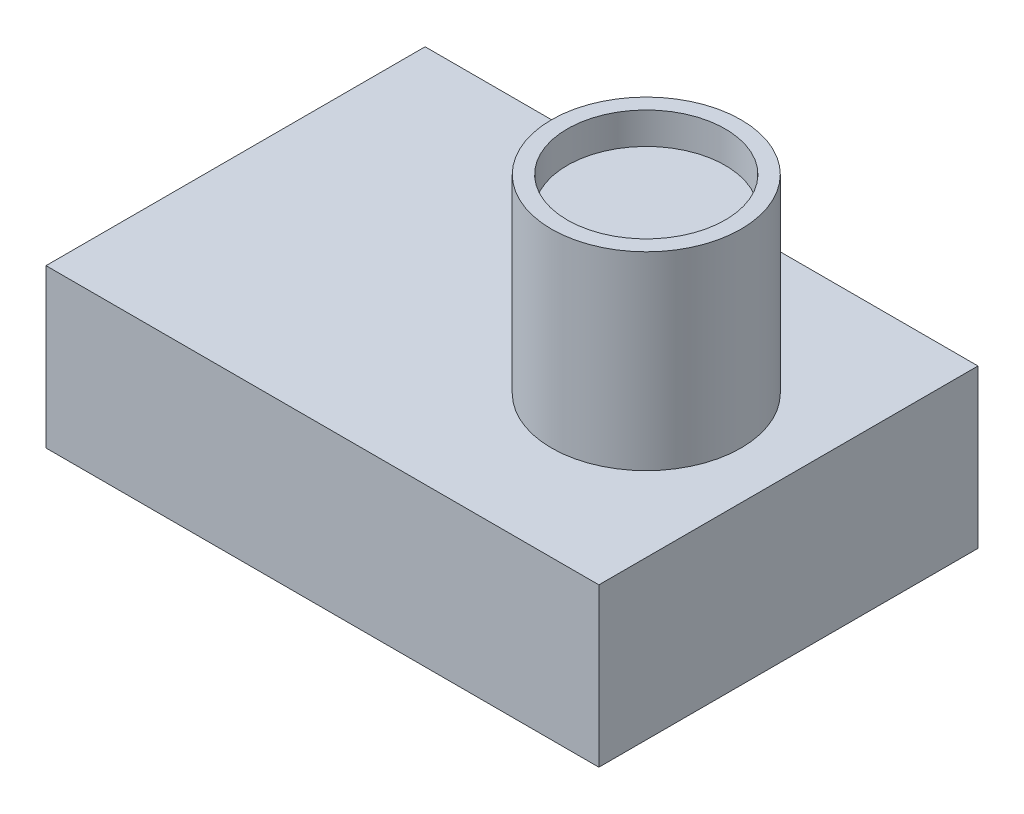
ISO-10303-21;
HEADER;
FILE_DESCRIPTION(('STEP AP214'),'2;1');
FILE_NAME('part.step','',(''),(''),'','','');
FILE_SCHEMA(('AUTOMOTIVE_DESIGN { 1 0 10303 214 1 1 1 1 }'));
ENDSEC;
DATA;
#1=APPLICATION_CONTEXT('core data for automotive mechanical design processes');
#2=APPLICATION_PROTOCOL_DEFINITION('international standard','automotive_design',2000,#1);
#3=PRODUCT_CONTEXT('',#1,'mechanical');
#4=PRODUCT('Part','Part','',(#3));
#5=PRODUCT_RELATED_PRODUCT_CATEGORY('part','',(#4));
#6=PRODUCT_DEFINITION_FORMATION('','',#4);
#7=PRODUCT_DEFINITION_CONTEXT('part definition',#1,'design');
#8=PRODUCT_DEFINITION('design','',#6,#7);
#9=PRODUCT_DEFINITION_SHAPE('','',#8);
#10=(LENGTH_UNIT() NAMED_UNIT(*) SI_UNIT(.MILLI.,.METRE.));
#11=(NAMED_UNIT(*) PLANE_ANGLE_UNIT() SI_UNIT($,.RADIAN.));
#12=(NAMED_UNIT(*) SI_UNIT($,.STERADIAN.) SOLID_ANGLE_UNIT());
#13=UNCERTAINTY_MEASURE_WITH_UNIT(LENGTH_MEASURE(1.E-05),#10,'distance_accuracy_value','');
#14=(GEOMETRIC_REPRESENTATION_CONTEXT(3) GLOBAL_UNCERTAINTY_ASSIGNED_CONTEXT((#13)) GLOBAL_UNIT_ASSIGNED_CONTEXT((#10,
#11,#12)) REPRESENTATION_CONTEXT('',''));
#15=CARTESIAN_POINT('',(0.,0.,0.));
#16=DIRECTION('',(0.,0.,1.));
#17=DIRECTION('',(1.,0.,0.));
#18=AXIS2_PLACEMENT_3D('',#15,#16,#17);
#19=CARTESIAN_POINT('',(17.5,10.,-12.));
#20=DIRECTION('',(-1.,0.,0.));
#21=DIRECTION('',(0.,0.,1.));
#22=AXIS2_PLACEMENT_3D('',#19,#20,#21);
#23=PLANE('',#22);
#24=DIRECTION('',(0.,0.,-1.));
#25=VECTOR('',#24,1.);
#26=CARTESIAN_POINT('',(17.5,0.,-12.));
#27=LINE('',#26,#25);
#28=CARTESIAN_POINT('',(17.5,0.,12.));
#29=VERTEX_POINT('',#28);
#30=CARTESIAN_POINT('',(17.5,0.,-12.));
#31=VERTEX_POINT('',#30);
#32=EDGE_CURVE('E105',#29,#31,#27,.T.);
#33=ORIENTED_EDGE('',*,*,#32,.T.);
#34=DIRECTION('',(0.,-1.,0.));
#35=VECTOR('',#34,1.);
#36=CARTESIAN_POINT('',(17.5,10.,-12.));
#37=LINE('',#36,#35);
#38=CARTESIAN_POINT('',(17.5,10.,-12.));
#39=VERTEX_POINT('',#38);
#40=EDGE_CURVE('E11',#39,#31,#37,.T.);
#41=ORIENTED_EDGE('',*,*,#40,.F.);
#42=DIRECTION('',(0.,0.,-1.));
#43=VECTOR('',#42,1.);
#44=CARTESIAN_POINT('',(17.5,10.,-12.));
#45=LINE('',#44,#43);
#46=CARTESIAN_POINT('',(17.5,10.,12.));
#47=VERTEX_POINT('',#46);
#48=EDGE_CURVE('E93',#47,#39,#45,.T.);
#49=ORIENTED_EDGE('',*,*,#48,.F.);
#50=DIRECTION('',(0.,-1.,0.));
#51=VECTOR('',#50,1.);
#52=CARTESIAN_POINT('',(17.5,10.,12.));
#53=LINE('',#52,#51);
#54=EDGE_CURVE('E101',#47,#29,#53,.T.);
#55=ORIENTED_EDGE('',*,*,#54,.T.);
#56=EDGE_LOOP('',(#33,#41,#49,#55));
#57=FACE_BOUND('',#56,.T.);
#58=ADVANCED_FACE('F42',(#57),#23,.F.);
#59=CARTESIAN_POINT('',(-17.5,10.,-12.));
#60=DIRECTION('',(0.,0.,1.));
#61=DIRECTION('',(1.,0.,0.));
#62=AXIS2_PLACEMENT_3D('',#59,#60,#61);
#63=PLANE('',#62);
#64=DIRECTION('',(-1.,0.,0.));
#65=VECTOR('',#64,1.);
#66=CARTESIAN_POINT('',(-17.5,0.,-12.));
#67=LINE('',#66,#65);
#68=CARTESIAN_POINT('',(-17.5,0.,-12.));
#69=VERTEX_POINT('',#68);
#70=EDGE_CURVE('E97',#31,#69,#67,.T.);
#71=ORIENTED_EDGE('',*,*,#70,.T.);
#72=DIRECTION('',(0.,-1.,0.));
#73=VECTOR('',#72,1.);
#74=CARTESIAN_POINT('',(-17.5,10.,-12.));
#75=LINE('',#74,#73);
#76=CARTESIAN_POINT('',(-17.5,10.,-12.));
#77=VERTEX_POINT('',#76);
#78=EDGE_CURVE('E50',#77,#69,#75,.T.);
#79=ORIENTED_EDGE('',*,*,#78,.F.);
#80=DIRECTION('',(-1.,0.,0.));
#81=VECTOR('',#80,1.);
#82=CARTESIAN_POINT('',(-17.5,10.,-12.));
#83=LINE('',#82,#81);
#84=EDGE_CURVE('E88',#39,#77,#83,.T.);
#85=ORIENTED_EDGE('',*,*,#84,.F.);
#86=ORIENTED_EDGE('',*,*,#40,.T.);
#87=EDGE_LOOP('',(#71,#79,#85,#86));
#88=FACE_BOUND('',#87,.T.);
#89=ADVANCED_FACE('F96',(#88),#63,.F.);
#90=CARTESIAN_POINT('',(-17.5,10.,-12.));
#91=DIRECTION('',(1.,0.,0.));
#92=DIRECTION('',(0.,0.,-1.));
#93=AXIS2_PLACEMENT_3D('',#90,#91,#92);
#94=PLANE('',#93);
#95=DIRECTION('',(0.,0.,1.));
#96=VECTOR('',#95,1.);
#97=CARTESIAN_POINT('',(-17.5,0.,-12.));
#98=LINE('',#97,#96);
#99=CARTESIAN_POINT('',(-17.5,0.,12.));
#100=VERTEX_POINT('',#99);
#101=EDGE_CURVE('E75',#69,#100,#98,.T.);
#102=ORIENTED_EDGE('',*,*,#101,.T.);
#103=DIRECTION('',(0.,-1.,0.));
#104=VECTOR('',#103,1.);
#105=CARTESIAN_POINT('',(-17.5,10.,12.));
#106=LINE('',#105,#104);
#107=CARTESIAN_POINT('',(-17.5,10.,12.));
#108=VERTEX_POINT('',#107);
#109=EDGE_CURVE('E98',#108,#100,#106,.T.);
#110=ORIENTED_EDGE('',*,*,#109,.F.);
#111=DIRECTION('',(0.,0.,1.));
#112=VECTOR('',#111,1.);
#113=CARTESIAN_POINT('',(-17.5,10.,-12.));
#114=LINE('',#113,#112);
#115=EDGE_CURVE('E91',#77,#108,#114,.T.);
#116=ORIENTED_EDGE('',*,*,#115,.F.);
#117=ORIENTED_EDGE('',*,*,#78,.T.);
#118=EDGE_LOOP('',(#102,#110,#116,#117));
#119=FACE_BOUND('',#118,.T.);
#120=ADVANCED_FACE('F99',(#119),#94,.F.);
#121=CARTESIAN_POINT('',(-17.5,10.,12.));
#122=DIRECTION('',(0.,0.,-1.));
#123=DIRECTION('',(-1.,0.,0.));
#124=AXIS2_PLACEMENT_3D('',#121,#122,#123);
#125=PLANE('',#124);
#126=DIRECTION('',(1.,0.,0.));
#127=VECTOR('',#126,1.);
#128=CARTESIAN_POINT('',(-17.5,0.,12.));
#129=LINE('',#128,#127);
#130=EDGE_CURVE('E81',#100,#29,#129,.T.);
#131=ORIENTED_EDGE('',*,*,#130,.T.);
#132=ORIENTED_EDGE('',*,*,#54,.F.);
#133=DIRECTION('',(1.,0.,0.));
#134=VECTOR('',#133,1.);
#135=CARTESIAN_POINT('',(-17.5,10.,12.));
#136=LINE('',#135,#134);
#137=EDGE_CURVE('E58',#108,#47,#136,.T.);
#138=ORIENTED_EDGE('',*,*,#137,.F.);
#139=ORIENTED_EDGE('',*,*,#109,.T.);
#140=EDGE_LOOP('',(#131,#132,#138,#139));
#141=FACE_BOUND('',#140,.T.);
#142=ADVANCED_FACE('F113',(#141),#125,.F.);
#143=CARTESIAN_POINT('',(0.,10.,0.));
#144=DIRECTION('',(0.,1.,0.));
#145=DIRECTION('',(0.,0.,1.));
#146=AXIS2_PLACEMENT_3D('',#143,#144,#145);
#147=PLANE('',#146);
#148=CARTESIAN_POINT('',(8.5,10.,0.));
#149=DIRECTION('',(0.,1.,0.));
#150=DIRECTION('',(0.,0.,1.));
#151=AXIS2_PLACEMENT_3D('',#148,#149,#150);
#152=CIRCLE('',#151,6.00000000000001);
#153=CARTESIAN_POINT('',(8.5,10.,6.00000000000001));
#154=VERTEX_POINT('',#153);
#155=EDGE_CURVE('E119',#154,#154,#152,.T.);
#156=ORIENTED_EDGE('',*,*,#155,.F.);
#157=EDGE_LOOP('',(#156));
#158=FACE_BOUND('',#157,.T.);
#159=ORIENTED_EDGE('',*,*,#48,.T.);
#160=ORIENTED_EDGE('',*,*,#84,.T.);
#161=ORIENTED_EDGE('',*,*,#115,.T.);
#162=ORIENTED_EDGE('',*,*,#137,.T.);
#163=EDGE_LOOP('',(#159,#160,#161,#162));
#164=FACE_BOUND('',#163,.T.);
#165=ADVANCED_FACE('F89',(#158,#164),#147,.T.);
#166=CARTESIAN_POINT('',(0.,0.,0.));
#167=DIRECTION('',(0.,1.,0.));
#168=DIRECTION('',(0.,0.,1.));
#169=AXIS2_PLACEMENT_3D('',#166,#167,#168);
#170=PLANE('',#169);
#171=ORIENTED_EDGE('',*,*,#32,.F.);
#172=ORIENTED_EDGE('',*,*,#130,.F.);
#173=ORIENTED_EDGE('',*,*,#101,.F.);
#174=ORIENTED_EDGE('',*,*,#70,.F.);
#175=EDGE_LOOP('',(#171,#172,#173,#174));
#176=FACE_BOUND('',#175,.T.);
#177=ADVANCED_FACE('F116',(#176),#170,.F.);
#178=CARTESIAN_POINT('',(8.5,22.,0.));
#179=DIRECTION('',(0.,-1.,0.));
#180=DIRECTION('',(0.,0.,-1.));
#181=AXIS2_PLACEMENT_3D('',#178,#179,#180);
#182=CYLINDRICAL_SURFACE('',#181,6.00000000000001);
#183=CARTESIAN_POINT('',(8.5,22.,0.));
#184=DIRECTION('',(0.,1.,0.));
#185=DIRECTION('',(0.,0.,1.));
#186=AXIS2_PLACEMENT_3D('',#183,#184,#185);
#187=CIRCLE('',#186,6.00000000000001);
#188=CARTESIAN_POINT('',(8.5,22.,6.00000000000001));
#189=VERTEX_POINT('',#188);
#190=EDGE_CURVE('E108',#189,#189,#187,.T.);
#191=ORIENTED_EDGE('',*,*,#190,.F.);
#192=EDGE_LOOP('',(#191));
#193=FACE_BOUND('',#192,.T.);
#194=ORIENTED_EDGE('',*,*,#155,.T.);
#195=EDGE_LOOP('',(#194));
#196=FACE_BOUND('',#195,.T.);
#197=ADVANCED_FACE('F142',(#193,#196),#182,.T.);
#198=CARTESIAN_POINT('',(8.5,22.,0.));
#199=DIRECTION('',(0.,1.,0.));
#200=DIRECTION('',(0.,0.,1.));
#201=AXIS2_PLACEMENT_3D('',#198,#199,#200);
#202=PLANE('',#201);
#203=CARTESIAN_POINT('',(8.5,22.,0.));
#204=DIRECTION('',(0.,1.,0.));
#205=DIRECTION('',(0.,0.,1.));
#206=AXIS2_PLACEMENT_3D('',#203,#204,#205);
#207=CIRCLE('',#206,5.);
#208=CARTESIAN_POINT('',(8.5,22.,5.));
#209=VERTEX_POINT('',#208);
#210=EDGE_CURVE('E125',#209,#209,#207,.T.);
#211=ORIENTED_EDGE('',*,*,#210,.F.);
#212=EDGE_LOOP('',(#211));
#213=FACE_BOUND('',#212,.T.);
#214=ORIENTED_EDGE('',*,*,#190,.T.);
#215=EDGE_LOOP('',(#214));
#216=FACE_BOUND('',#215,.T.);
#217=ADVANCED_FACE('F136',(#213,#216),#202,.T.);
#218=CARTESIAN_POINT('',(8.5,20.,0.));
#219=DIRECTION('',(0.,1.,0.));
#220=DIRECTION('',(0.,0.,1.));
#221=AXIS2_PLACEMENT_3D('',#218,#219,#220);
#222=CYLINDRICAL_SURFACE('',#221,5.);
#223=CARTESIAN_POINT('',(8.5,20.,0.));
#224=DIRECTION('',(0.,1.,0.));
#225=DIRECTION('',(0.,0.,1.));
#226=AXIS2_PLACEMENT_3D('',#223,#224,#225);
#227=CIRCLE('',#226,5.);
#228=CARTESIAN_POINT('',(8.5,20.,5.));
#229=VERTEX_POINT('',#228);
#230=EDGE_CURVE('E122',#229,#229,#227,.T.);
#231=ORIENTED_EDGE('',*,*,#230,.F.);
#232=EDGE_LOOP('',(#231));
#233=FACE_BOUND('',#232,.T.);
#234=ORIENTED_EDGE('',*,*,#210,.T.);
#235=EDGE_LOOP('',(#234));
#236=FACE_BOUND('',#235,.T.);
#237=ADVANCED_FACE('F133',(#233,#236),#222,.F.);
#238=CARTESIAN_POINT('',(8.5,20.,0.));
#239=DIRECTION('',(0.,1.,0.));
#240=DIRECTION('',(0.,0.,1.));
#241=AXIS2_PLACEMENT_3D('',#238,#239,#240);
#242=PLANE('',#241);
#243=ORIENTED_EDGE('',*,*,#230,.T.);
#244=EDGE_LOOP('',(#243));
#245=FACE_BOUND('',#244,.T.);
#246=ADVANCED_FACE('F131',(#245),#242,.T.);
#247=CLOSED_SHELL('',(#58,#89,#120,#142,#165,#177,#197,#217,#237,#246));
#248=MANIFOLD_SOLID_BREP('B2',#247);
#249=ADVANCED_BREP_SHAPE_REPRESENTATION('',(#18,#248),#14);
#250=SHAPE_DEFINITION_REPRESENTATION(#9,#249);
ENDSEC;
END-ISO-10303-21;
